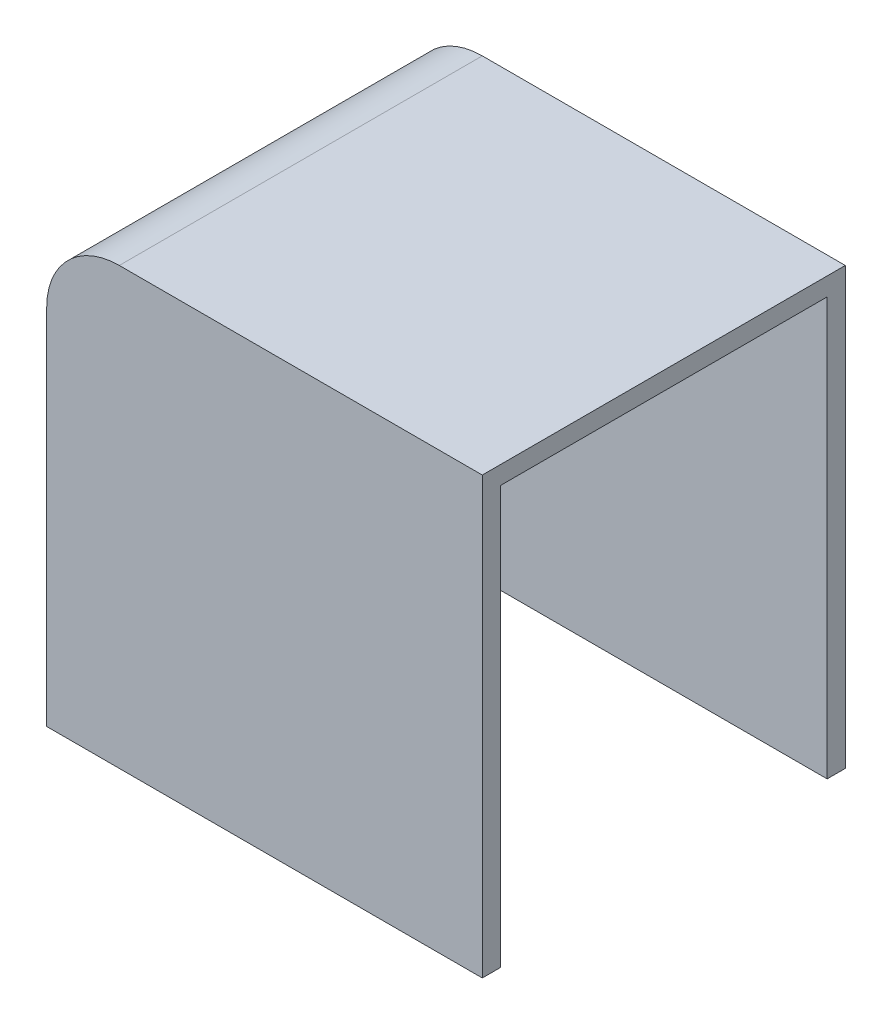
ISO-10303-21;
HEADER;
FILE_DESCRIPTION(('STEP AP214'),'2;1');
FILE_NAME('part.step','',(''),(''),'','','');
FILE_SCHEMA(('AUTOMOTIVE_DESIGN { 1 0 10303 214 1 1 1 1 }'));
ENDSEC;
DATA;
#1=APPLICATION_CONTEXT('core data for automotive mechanical design processes');
#2=APPLICATION_PROTOCOL_DEFINITION('international standard','automotive_design',2000,#1);
#3=PRODUCT_CONTEXT('',#1,'mechanical');
#4=PRODUCT('Part','Part','',(#3));
#5=PRODUCT_RELATED_PRODUCT_CATEGORY('part','',(#4));
#6=PRODUCT_DEFINITION_FORMATION('','',#4);
#7=PRODUCT_DEFINITION_CONTEXT('part definition',#1,'design');
#8=PRODUCT_DEFINITION('design','',#6,#7);
#9=PRODUCT_DEFINITION_SHAPE('','',#8);
#10=(LENGTH_UNIT() NAMED_UNIT(*) SI_UNIT(.MILLI.,.METRE.));
#11=(NAMED_UNIT(*) PLANE_ANGLE_UNIT() SI_UNIT($,.RADIAN.));
#12=(NAMED_UNIT(*) SI_UNIT($,.STERADIAN.) SOLID_ANGLE_UNIT());
#13=UNCERTAINTY_MEASURE_WITH_UNIT(LENGTH_MEASURE(1.E-05),#10,'distance_accuracy_value','');
#14=(GEOMETRIC_REPRESENTATION_CONTEXT(3) GLOBAL_UNCERTAINTY_ASSIGNED_CONTEXT((#13)) GLOBAL_UNIT_ASSIGNED_CONTEXT((#10,
#11,#12)) REPRESENTATION_CONTEXT('',''));
#15=CARTESIAN_POINT('',(0.,0.,0.));
#16=DIRECTION('',(0.,0.,1.));
#17=DIRECTION('',(1.,0.,0.));
#18=AXIS2_PLACEMENT_3D('',#15,#16,#17);
#19=CARTESIAN_POINT('',(-11.5,0.,9.));
#20=DIRECTION('',(0.,1.,0.));
#21=DIRECTION('',(-1.,0.,0.));
#22=AXIS2_PLACEMENT_3D('',#19,#20,#21);
#23=PLANE('',#22);
#24=DIRECTION('',(0.,0.,-1.));
#25=VECTOR('',#24,1.);
#26=CARTESIAN_POINT('',(-12.,0.,9.));
#27=LINE('',#26,#25);
#28=CARTESIAN_POINT('',(-12.,0.,9.5));
#29=VERTEX_POINT('',#28);
#30=CARTESIAN_POINT('',(-12.,0.,-0.5));
#31=VERTEX_POINT('',#30);
#32=EDGE_CURVE('E112',#29,#31,#27,.T.);
#33=ORIENTED_EDGE('',*,*,#32,.T.);
#34=DIRECTION('',(-1.,0.,0.));
#35=VECTOR('',#34,1.);
#36=CARTESIAN_POINT('',(0.,0.,-0.5));
#37=LINE('',#36,#35);
#38=CARTESIAN_POINT('',(0.,0.,-0.5));
#39=VERTEX_POINT('',#38);
#40=EDGE_CURVE('E106',#39,#31,#37,.T.);
#41=ORIENTED_EDGE('',*,*,#40,.F.);
#42=DIRECTION('',(0.,0.,1.));
#43=VECTOR('',#42,1.);
#44=CARTESIAN_POINT('',(0.,0.,-0.5));
#45=LINE('',#44,#43);
#46=CARTESIAN_POINT('',(0.,0.,0.));
#47=VERTEX_POINT('',#46);
#48=EDGE_CURVE('E110',#39,#47,#45,.T.);
#49=ORIENTED_EDGE('',*,*,#48,.T.);
#50=DIRECTION('',(-1.,0.,0.));
#51=VECTOR('',#50,1.);
#52=CARTESIAN_POINT('',(0.,0.,0.));
#53=LINE('',#52,#51);
#54=CARTESIAN_POINT('',(-11.5,0.,0.));
#55=VERTEX_POINT('',#54);
#56=EDGE_CURVE('E126',#47,#55,#53,.T.);
#57=ORIENTED_EDGE('',*,*,#56,.T.);
#58=DIRECTION('',(0.,0.,-1.));
#59=VECTOR('',#58,1.);
#60=CARTESIAN_POINT('',(-11.5,0.,9.));
#61=LINE('',#60,#59);
#62=CARTESIAN_POINT('',(-11.5,0.,9.));
#63=VERTEX_POINT('',#62);
#64=EDGE_CURVE('E11',#63,#55,#61,.T.);
#65=ORIENTED_EDGE('',*,*,#64,.F.);
#66=DIRECTION('',(1.,0.,0.));
#67=VECTOR('',#66,1.);
#68=CARTESIAN_POINT('',(0.,0.,9.));
#69=LINE('',#68,#67);
#70=CARTESIAN_POINT('',(0.,0.,9.));
#71=VERTEX_POINT('',#70);
#72=EDGE_CURVE('E132',#63,#71,#69,.T.);
#73=ORIENTED_EDGE('',*,*,#72,.T.);
#74=DIRECTION('',(0.,0.,-1.));
#75=VECTOR('',#74,1.);
#76=CARTESIAN_POINT('',(0.,0.,9.5));
#77=LINE('',#76,#75);
#78=CARTESIAN_POINT('',(0.,0.,9.5));
#79=VERTEX_POINT('',#78);
#80=EDGE_CURVE('E154',#79,#71,#77,.T.);
#81=ORIENTED_EDGE('',*,*,#80,.F.);
#82=DIRECTION('',(1.,0.,0.));
#83=VECTOR('',#82,1.);
#84=CARTESIAN_POINT('',(0.,0.,9.5));
#85=LINE('',#84,#83);
#86=EDGE_CURVE('E144',#29,#79,#85,.T.);
#87=ORIENTED_EDGE('',*,*,#86,.F.);
#88=EDGE_LOOP('',(#33,#41,#49,#57,#65,#73,#81,#87));
#89=FACE_BOUND('',#88,.T.);
#90=ADVANCED_FACE('F33',(#89),#23,.F.);
#91=CARTESIAN_POINT('',(-11.5,9.5,9.));
#92=DIRECTION('',(-1.,0.,0.));
#93=DIRECTION('',(0.,-1.,0.));
#94=AXIS2_PLACEMENT_3D('',#91,#92,#93);
#95=PLANE('',#94);
#96=DIRECTION('',(0.,1.,0.));
#97=VECTOR('',#96,1.);
#98=CARTESIAN_POINT('',(-11.5,9.5,0.));
#99=LINE('',#98,#97);
#100=CARTESIAN_POINT('',(-11.5,9.5,0.));
#101=VERTEX_POINT('',#100);
#102=EDGE_CURVE('E160',#55,#101,#99,.T.);
#103=ORIENTED_EDGE('',*,*,#102,.T.);
#104=DIRECTION('',(0.,0.,-1.));
#105=VECTOR('',#104,1.);
#106=CARTESIAN_POINT('',(-11.5,9.5,9.));
#107=LINE('',#106,#105);
#108=CARTESIAN_POINT('',(-11.5,9.5,9.));
#109=VERTEX_POINT('',#108);
#110=EDGE_CURVE('E41',#109,#101,#107,.T.);
#111=ORIENTED_EDGE('',*,*,#110,.F.);
#112=DIRECTION('',(0.,1.,0.));
#113=VECTOR('',#112,1.);
#114=CARTESIAN_POINT('',(-11.5,9.5,9.));
#115=LINE('',#114,#113);
#116=EDGE_CURVE('E161',#63,#109,#115,.T.);
#117=ORIENTED_EDGE('',*,*,#116,.F.);
#118=ORIENTED_EDGE('',*,*,#64,.T.);
#119=EDGE_LOOP('',(#103,#111,#117,#118));
#120=FACE_BOUND('',#119,.T.);
#121=ADVANCED_FACE('F190',(#120),#95,.F.);
#122=CARTESIAN_POINT('',(-9.50000000000001,9.5,9.));
#123=DIRECTION('',(0.,0.,-1.));
#124=DIRECTION('',(-1.,0.,0.));
#125=AXIS2_PLACEMENT_3D('',#122,#123,#124);
#126=CYLINDRICAL_SURFACE('',#125,2.);
#127=CARTESIAN_POINT('',(-9.50000000000001,9.5,0.));
#128=DIRECTION('',(0.,0.,-1.));
#129=DIRECTION('',(-1.,0.,0.));
#130=AXIS2_PLACEMENT_3D('',#127,#128,#129);
#131=CIRCLE('',#130,2.);
#132=CARTESIAN_POINT('',(-9.50000000000001,11.5,0.));
#133=VERTEX_POINT('',#132);
#134=EDGE_CURVE('E173',#101,#133,#131,.T.);
#135=ORIENTED_EDGE('',*,*,#134,.T.);
#136=DIRECTION('',(0.,0.,-1.));
#137=VECTOR('',#136,1.);
#138=CARTESIAN_POINT('',(-9.50000000000001,11.5,9.));
#139=LINE('',#138,#137);
#140=CARTESIAN_POINT('',(-9.50000000000001,11.5,9.));
#141=VERTEX_POINT('',#140);
#142=EDGE_CURVE('E48',#141,#133,#139,.T.);
#143=ORIENTED_EDGE('',*,*,#142,.F.);
#144=CARTESIAN_POINT('',(-9.50000000000001,9.5,9.));
#145=DIRECTION('',(0.,0.,-1.));
#146=DIRECTION('',(-1.,0.,0.));
#147=AXIS2_PLACEMENT_3D('',#144,#145,#146);
#148=CIRCLE('',#147,2.);
#149=EDGE_CURVE('E164',#109,#141,#148,.T.);
#150=ORIENTED_EDGE('',*,*,#149,.F.);
#151=ORIENTED_EDGE('',*,*,#110,.T.);
#152=EDGE_LOOP('',(#135,#143,#150,#151));
#153=FACE_BOUND('',#152,.T.);
#154=ADVANCED_FACE('F187',(#153),#126,.F.);
#155=CARTESIAN_POINT('',(0.,11.5,9.));
#156=DIRECTION('',(0.,1.,0.));
#157=DIRECTION('',(-1.,0.,0.));
#158=AXIS2_PLACEMENT_3D('',#155,#156,#157);
#159=PLANE('',#158);
#160=DIRECTION('',(1.,0.,0.));
#161=VECTOR('',#160,1.);
#162=CARTESIAN_POINT('',(0.,11.5,0.));
#163=LINE('',#162,#161);
#164=CARTESIAN_POINT('',(0.,11.5,0.));
#165=VERTEX_POINT('',#164);
#166=EDGE_CURVE('E165',#133,#165,#163,.T.);
#167=ORIENTED_EDGE('',*,*,#166,.T.);
#168=DIRECTION('',(0.,0.,-1.));
#169=VECTOR('',#168,1.);
#170=CARTESIAN_POINT('',(0.,11.5,9.));
#171=LINE('',#170,#169);
#172=CARTESIAN_POINT('',(0.,11.5,9.));
#173=VERTEX_POINT('',#172);
#174=EDGE_CURVE('E184',#173,#165,#171,.T.);
#175=ORIENTED_EDGE('',*,*,#174,.F.);
#176=DIRECTION('',(1.,0.,0.));
#177=VECTOR('',#176,1.);
#178=CARTESIAN_POINT('',(0.,11.5,9.));
#179=LINE('',#178,#177);
#180=EDGE_CURVE('E168',#141,#173,#179,.T.);
#181=ORIENTED_EDGE('',*,*,#180,.F.);
#182=ORIENTED_EDGE('',*,*,#142,.T.);
#183=EDGE_LOOP('',(#167,#175,#181,#182));
#184=FACE_BOUND('',#183,.T.);
#185=ADVANCED_FACE('F214',(#184),#159,.F.);
#186=CARTESIAN_POINT('',(0.,12.,9.));
#187=DIRECTION('',(-1.,0.,0.));
#188=DIRECTION('',(0.,-1.,0.));
#189=AXIS2_PLACEMENT_3D('',#186,#187,#188);
#190=PLANE('',#189);
#191=ORIENTED_EDGE('',*,*,#174,.T.);
#192=DIRECTION('',(0.,-1.,0.));
#193=VECTOR('',#192,1.);
#194=CARTESIAN_POINT('',(0.,12.,0.));
#195=LINE('',#194,#193);
#196=EDGE_CURVE('E130',#165,#47,#195,.T.);
#197=ORIENTED_EDGE('',*,*,#196,.T.);
#198=ORIENTED_EDGE('',*,*,#48,.F.);
#199=DIRECTION('',(0.,-1.,0.));
#200=VECTOR('',#199,1.);
#201=CARTESIAN_POINT('',(0.,12.,-0.5));
#202=LINE('',#201,#200);
#203=CARTESIAN_POINT('',(0.,12.,-0.5));
#204=VERTEX_POINT('',#203);
#205=EDGE_CURVE('E117',#204,#39,#202,.T.);
#206=ORIENTED_EDGE('',*,*,#205,.F.);
#207=DIRECTION('',(0.,0.,-1.));
#208=VECTOR('',#207,1.);
#209=CARTESIAN_POINT('',(0.,12.,9.));
#210=LINE('',#209,#208);
#211=CARTESIAN_POINT('',(0.,12.,9.5));
#212=VERTEX_POINT('',#211);
#213=EDGE_CURVE('E182',#212,#204,#210,.T.);
#214=ORIENTED_EDGE('',*,*,#213,.F.);
#215=DIRECTION('',(0.,1.,0.));
#216=VECTOR('',#215,1.);
#217=CARTESIAN_POINT('',(0.,12.,9.5));
#218=LINE('',#217,#216);
#219=EDGE_CURVE('E146',#79,#212,#218,.T.);
#220=ORIENTED_EDGE('',*,*,#219,.F.);
#221=ORIENTED_EDGE('',*,*,#80,.T.);
#222=DIRECTION('',(0.,1.,0.));
#223=VECTOR('',#222,1.);
#224=CARTESIAN_POINT('',(0.,12.,9.));
#225=LINE('',#224,#223);
#226=EDGE_CURVE('E134',#71,#173,#225,.T.);
#227=ORIENTED_EDGE('',*,*,#226,.T.);
#228=EDGE_LOOP('',(#191,#197,#198,#206,#214,#220,#221,#227));
#229=FACE_BOUND('',#228,.T.);
#230=ADVANCED_FACE('F129',(#229),#190,.F.);
#231=CARTESIAN_POINT('',(-10.,12.,9.));
#232=DIRECTION('',(0.,-1.,0.));
#233=DIRECTION('',(0.,0.,-1.));
#234=AXIS2_PLACEMENT_3D('',#231,#232,#233);
#235=PLANE('',#234);
#236=ORIENTED_EDGE('',*,*,#213,.T.);
#237=DIRECTION('',(1.,0.,0.));
#238=VECTOR('',#237,1.);
#239=CARTESIAN_POINT('',(0.,12.,-0.5));
#240=LINE('',#239,#238);
#241=CARTESIAN_POINT('',(-10.,12.,-0.5));
#242=VERTEX_POINT('',#241);
#243=EDGE_CURVE('E124',#242,#204,#240,.T.);
#244=ORIENTED_EDGE('',*,*,#243,.F.);
#245=DIRECTION('',(0.,0.,-1.));
#246=VECTOR('',#245,1.);
#247=CARTESIAN_POINT('',(-10.,12.,9.));
#248=LINE('',#247,#246);
#249=CARTESIAN_POINT('',(-10.,12.,9.5));
#250=VERTEX_POINT('',#249);
#251=EDGE_CURVE('E180',#250,#242,#248,.T.);
#252=ORIENTED_EDGE('',*,*,#251,.F.);
#253=DIRECTION('',(-1.,0.,0.));
#254=VECTOR('',#253,1.);
#255=CARTESIAN_POINT('',(0.,12.,9.5));
#256=LINE('',#255,#254);
#257=EDGE_CURVE('E149',#212,#250,#256,.T.);
#258=ORIENTED_EDGE('',*,*,#257,.F.);
#259=EDGE_LOOP('',(#236,#244,#252,#258));
#260=FACE_BOUND('',#259,.T.);
#261=ADVANCED_FACE('F204',(#260),#235,.F.);
#262=CARTESIAN_POINT('',(-10.,10.,9.));
#263=DIRECTION('',(0.,0.,-1.));
#264=DIRECTION('',(-1.,0.,0.));
#265=AXIS2_PLACEMENT_3D('',#262,#263,#264);
#266=CYLINDRICAL_SURFACE('',#265,2.);
#267=ORIENTED_EDGE('',*,*,#251,.T.);
#268=CARTESIAN_POINT('',(-10.,10.,-0.5));
#269=DIRECTION('',(0.,0.,-1.));
#270=DIRECTION('',(-1.,0.,0.));
#271=AXIS2_PLACEMENT_3D('',#268,#269,#270);
#272=CIRCLE('',#271,2.);
#273=CARTESIAN_POINT('',(-12.,10.,-0.5));
#274=VERTEX_POINT('',#273);
#275=EDGE_CURVE('E136',#274,#242,#272,.T.);
#276=ORIENTED_EDGE('',*,*,#275,.F.);
#277=DIRECTION('',(0.,0.,-1.));
#278=VECTOR('',#277,1.);
#279=CARTESIAN_POINT('',(-12.,10.,9.));
#280=LINE('',#279,#278);
#281=CARTESIAN_POINT('',(-12.,10.,9.5));
#282=VERTEX_POINT('',#281);
#283=EDGE_CURVE('E178',#282,#274,#280,.T.);
#284=ORIENTED_EDGE('',*,*,#283,.F.);
#285=CARTESIAN_POINT('',(-10.,10.,9.5));
#286=DIRECTION('',(0.,0.,1.));
#287=DIRECTION('',(1.,0.,0.));
#288=AXIS2_PLACEMENT_3D('',#285,#286,#287);
#289=CIRCLE('',#288,2.);
#290=EDGE_CURVE('E152',#250,#282,#289,.T.);
#291=ORIENTED_EDGE('',*,*,#290,.F.);
#292=EDGE_LOOP('',(#267,#276,#284,#291));
#293=FACE_BOUND('',#292,.T.);
#294=ADVANCED_FACE('F200',(#293),#266,.T.);
#295=CARTESIAN_POINT('',(-12.,0.,9.));
#296=DIRECTION('',(1.,0.,0.));
#297=DIRECTION('',(0.,0.,-1.));
#298=AXIS2_PLACEMENT_3D('',#295,#296,#297);
#299=PLANE('',#298);
#300=ORIENTED_EDGE('',*,*,#283,.T.);
#301=DIRECTION('',(0.,1.,0.));
#302=VECTOR('',#301,1.);
#303=CARTESIAN_POINT('',(-12.,10.,-0.5));
#304=LINE('',#303,#302);
#305=EDGE_CURVE('E116',#31,#274,#304,.T.);
#306=ORIENTED_EDGE('',*,*,#305,.F.);
#307=ORIENTED_EDGE('',*,*,#32,.F.);
#308=DIRECTION('',(0.,-1.,0.));
#309=VECTOR('',#308,1.);
#310=CARTESIAN_POINT('',(-12.,10.,9.5));
#311=LINE('',#310,#309);
#312=EDGE_CURVE('E141',#282,#29,#311,.T.);
#313=ORIENTED_EDGE('',*,*,#312,.F.);
#314=EDGE_LOOP('',(#300,#306,#307,#313));
#315=FACE_BOUND('',#314,.T.);
#316=ADVANCED_FACE('F264',(#315),#299,.F.);
#317=CARTESIAN_POINT('',(-10.,10.,9.));
#318=DIRECTION('',(0.,0.,1.));
#319=DIRECTION('',(1.,0.,0.));
#320=AXIS2_PLACEMENT_3D('',#317,#318,#319);
#321=PLANE('',#320);
#322=ORIENTED_EDGE('',*,*,#72,.F.);
#323=ORIENTED_EDGE('',*,*,#116,.T.);
#324=ORIENTED_EDGE('',*,*,#149,.T.);
#325=ORIENTED_EDGE('',*,*,#180,.T.);
#326=ORIENTED_EDGE('',*,*,#226,.F.);
#327=EDGE_LOOP('',(#322,#323,#324,#325,#326));
#328=FACE_BOUND('',#327,.T.);
#329=ADVANCED_FACE('F212',(#328),#321,.F.);
#330=CARTESIAN_POINT('',(-10.,10.,9.5));
#331=DIRECTION('',(0.,0.,1.));
#332=DIRECTION('',(1.,0.,0.));
#333=AXIS2_PLACEMENT_3D('',#330,#331,#332);
#334=PLANE('',#333);
#335=ORIENTED_EDGE('',*,*,#312,.T.);
#336=ORIENTED_EDGE('',*,*,#86,.T.);
#337=ORIENTED_EDGE('',*,*,#219,.T.);
#338=ORIENTED_EDGE('',*,*,#257,.T.);
#339=ORIENTED_EDGE('',*,*,#290,.T.);
#340=EDGE_LOOP('',(#335,#336,#337,#338,#339));
#341=FACE_BOUND('',#340,.T.);
#342=ADVANCED_FACE('F206',(#341),#334,.T.);
#343=CARTESIAN_POINT('',(-10.,10.,-0.5));
#344=DIRECTION('',(0.,0.,-1.));
#345=DIRECTION('',(-1.,0.,0.));
#346=AXIS2_PLACEMENT_3D('',#343,#344,#345);
#347=PLANE('',#346);
#348=ORIENTED_EDGE('',*,*,#205,.T.);
#349=ORIENTED_EDGE('',*,*,#40,.T.);
#350=ORIENTED_EDGE('',*,*,#305,.T.);
#351=ORIENTED_EDGE('',*,*,#275,.T.);
#352=ORIENTED_EDGE('',*,*,#243,.T.);
#353=EDGE_LOOP('',(#348,#349,#350,#351,#352));
#354=FACE_BOUND('',#353,.T.);
#355=ADVANCED_FACE('F121',(#354),#347,.T.);
#356=CARTESIAN_POINT('',(-10.,10.,0.));
#357=DIRECTION('',(0.,0.,-1.));
#358=DIRECTION('',(-1.,0.,0.));
#359=AXIS2_PLACEMENT_3D('',#356,#357,#358);
#360=PLANE('',#359);
#361=ORIENTED_EDGE('',*,*,#166,.F.);
#362=ORIENTED_EDGE('',*,*,#134,.F.);
#363=ORIENTED_EDGE('',*,*,#102,.F.);
#364=ORIENTED_EDGE('',*,*,#56,.F.);
#365=ORIENTED_EDGE('',*,*,#196,.F.);
#366=EDGE_LOOP('',(#361,#362,#363,#364,#365));
#367=FACE_BOUND('',#366,.T.);
#368=ADVANCED_FACE('F193',(#367),#360,.F.);
#369=CLOSED_SHELL('',(#90,#121,#154,#185,#230,#261,#294,#316,#329,#342,#355,#368));
#370=MANIFOLD_SOLID_BREP('B2',#369);
#371=ADVANCED_BREP_SHAPE_REPRESENTATION('',(#18,#370),#14);
#372=SHAPE_DEFINITION_REPRESENTATION(#9,#371);
ENDSEC;
END-ISO-10303-21;
